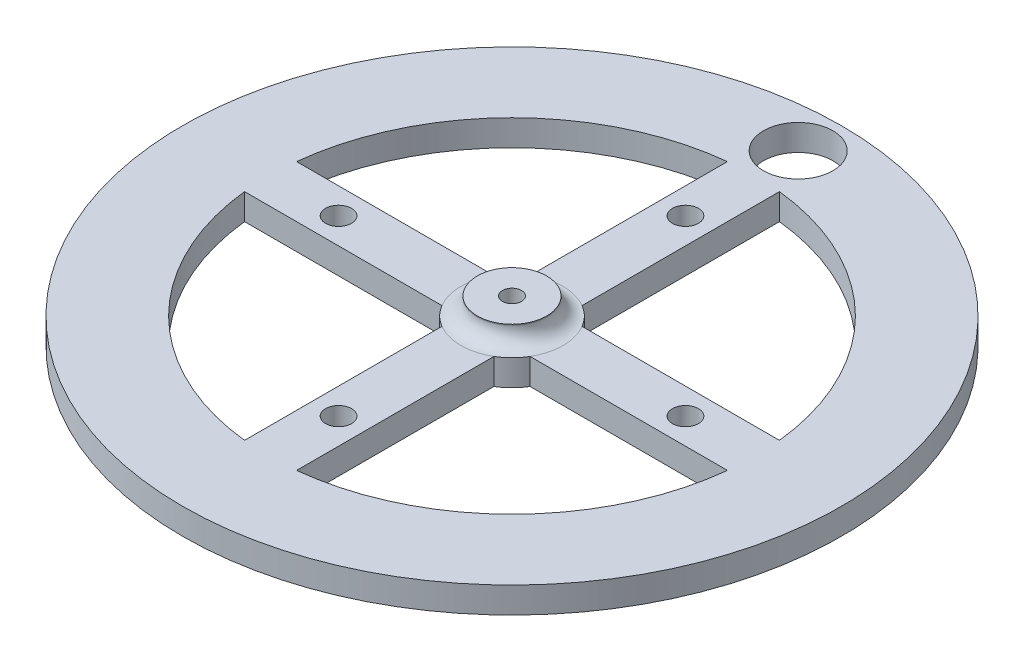
ISO-10303-21;
HEADER;
FILE_DESCRIPTION(('STEP AP214'),'2;1');
FILE_NAME('part.step','',(''),(''),'','','');
FILE_SCHEMA(('AUTOMOTIVE_DESIGN { 1 0 10303 214 1 1 1 1 }'));
ENDSEC;
DATA;
#1=APPLICATION_CONTEXT('core data for automotive mechanical design processes');
#2=APPLICATION_PROTOCOL_DEFINITION('international standard','automotive_design',2000,#1);
#3=PRODUCT_CONTEXT('',#1,'mechanical');
#4=PRODUCT('Part','Part','',(#3));
#5=PRODUCT_RELATED_PRODUCT_CATEGORY('part','',(#4));
#6=PRODUCT_DEFINITION_FORMATION('','',#4);
#7=PRODUCT_DEFINITION_CONTEXT('part definition',#1,'design');
#8=PRODUCT_DEFINITION('design','',#6,#7);
#9=PRODUCT_DEFINITION_SHAPE('','',#8);
#10=(LENGTH_UNIT() NAMED_UNIT(*) SI_UNIT(.MILLI.,.METRE.));
#11=(NAMED_UNIT(*) PLANE_ANGLE_UNIT() SI_UNIT($,.RADIAN.));
#12=(NAMED_UNIT(*) SI_UNIT($,.STERADIAN.) SOLID_ANGLE_UNIT());
#13=UNCERTAINTY_MEASURE_WITH_UNIT(LENGTH_MEASURE(1.E-05),#10,'distance_accuracy_value','');
#14=(GEOMETRIC_REPRESENTATION_CONTEXT(3) GLOBAL_UNCERTAINTY_ASSIGNED_CONTEXT((#13)) GLOBAL_UNIT_ASSIGNED_CONTEXT((#10,
#11,#12)) REPRESENTATION_CONTEXT('',''));
#15=CARTESIAN_POINT('',(0.,0.,0.));
#16=DIRECTION('',(0.,0.,1.));
#17=DIRECTION('',(1.,0.,0.));
#18=AXIS2_PLACEMENT_3D('',#15,#16,#17);
#19=CARTESIAN_POINT('',(4.,5.,0.));
#20=DIRECTION('',(0.,1.,0.));
#21=DIRECTION('',(0.,0.,1.));
#22=AXIS2_PLACEMENT_3D('',#19,#20,#21);
#23=PLANE('',#22);
#24=CARTESIAN_POINT('',(0.,5.,0.));
#25=DIRECTION('',(0.,-1.,0.));
#26=DIRECTION('',(0.,0.,-1.));
#27=AXIS2_PLACEMENT_3D('',#24,#25,#26);
#28=CIRCLE('',#27,1.1);
#29=CARTESIAN_POINT('',(0.,5.,-1.1));
#30=VERTEX_POINT('',#29);
#31=EDGE_CURVE('E297',#30,#30,#28,.T.);
#32=ORIENTED_EDGE('',*,*,#31,.T.);
#33=EDGE_LOOP('',(#32));
#34=FACE_BOUND('',#33,.T.);
#35=CARTESIAN_POINT('',(0.,5.,0.));
#36=DIRECTION('',(0.,-1.,0.));
#37=DIRECTION('',(0.,0.,-1.));
#38=AXIS2_PLACEMENT_3D('',#35,#36,#37);
#39=CIRCLE('',#38,4.);
#40=CARTESIAN_POINT('',(0.,5.,-4.));
#41=VERTEX_POINT('',#40);
#42=EDGE_CURVE('E11',#41,#41,#39,.T.);
#43=ORIENTED_EDGE('',*,*,#42,.F.);
#44=EDGE_LOOP('',(#43));
#45=FACE_BOUND('',#44,.T.);
#46=ADVANCED_FACE('F33',(#34,#45),#23,.T.);
#47=CARTESIAN_POINT('',(0.,0.,0.));
#48=DIRECTION('',(0.,-1.,0.));
#49=DIRECTION('',(0.,0.,-1.));
#50=AXIS2_PLACEMENT_3D('',#47,#48,#49);
#51=CYLINDRICAL_SURFACE('',#50,4.);
#52=ORIENTED_EDGE('',*,*,#42,.T.);
#53=EDGE_LOOP('',(#52));
#54=FACE_BOUND('',#53,.T.);
#55=CARTESIAN_POINT('',(0.,4.9,0.));
#56=DIRECTION('',(0.,-1.,0.));
#57=DIRECTION('',(0.,0.,-1.));
#58=AXIS2_PLACEMENT_3D('',#55,#56,#57);
#59=CIRCLE('',#58,4.);
#60=CARTESIAN_POINT('',(0.,4.9,-4.));
#61=VERTEX_POINT('',#60);
#62=EDGE_CURVE('E41',#61,#61,#59,.T.);
#63=ORIENTED_EDGE('',*,*,#62,.F.);
#64=EDGE_LOOP('',(#63));
#65=FACE_BOUND('',#64,.T.);
#66=ADVANCED_FACE('F351',(#54,#65),#51,.T.);
#67=CARTESIAN_POINT('',(0.,4.9,0.));
#68=DIRECTION('',(0.,-1.,0.));
#69=DIRECTION('',(0.,0.,-1.));
#70=AXIS2_PLACEMENT_3D('',#67,#68,#69);
#71=TOROIDAL_SURFACE('',#70,5.9,1.9);
#72=ORIENTED_EDGE('',*,*,#62,.T.);
#73=EDGE_LOOP('',(#72));
#74=FACE_BOUND('',#73,.T.);
#75=CARTESIAN_POINT('',(0.,3.,0.));
#76=DIRECTION('',(0.,-1.,0.));
#77=DIRECTION('',(0.,0.,-1.));
#78=AXIS2_PLACEMENT_3D('',#75,#76,#77);
#79=CIRCLE('',#78,5.9);
#80=CARTESIAN_POINT('',(3.,3.,-5.08035431835222));
#81=VERTEX_POINT('',#80);
#82=CARTESIAN_POINT('',(5.08035431835222,3.,-3.));
#83=VERTEX_POINT('',#82);
#84=EDGE_CURVE('E310',#81,#83,#79,.T.);
#85=ORIENTED_EDGE('',*,*,#84,.F.);
#86=CARTESIAN_POINT('',(-2.99999999999994,3.,-5.08035431835225));
#87=VERTEX_POINT('',#86);
#88=EDGE_CURVE('E309',#87,#81,#79,.T.);
#89=ORIENTED_EDGE('',*,*,#88,.F.);
#90=CARTESIAN_POINT('',(0.,3.,0.));
#91=DIRECTION('',(0.,1.,0.));
#92=DIRECTION('',(0.,0.,1.));
#93=AXIS2_PLACEMENT_3D('',#90,#91,#92);
#94=CIRCLE('',#93,5.9);
#95=CARTESIAN_POINT('',(-5.08035431835219,3.,-3.00000000000006));
#96=VERTEX_POINT('',#95);
#97=EDGE_CURVE('E228',#96,#87,#94,.F.);
#98=ORIENTED_EDGE('',*,*,#97,.F.);
#99=CARTESIAN_POINT('',(-5.08035431835222,3.,3.));
#100=VERTEX_POINT('',#99);
#101=EDGE_CURVE('E655',#100,#96,#79,.T.);
#102=ORIENTED_EDGE('',*,*,#101,.F.);
#103=CARTESIAN_POINT('',(0.,3.,0.));
#104=DIRECTION('',(0.,1.,0.));
#105=DIRECTION('',(0.,0.,1.));
#106=AXIS2_PLACEMENT_3D('',#103,#104,#105);
#107=CIRCLE('',#106,5.9);
#108=CARTESIAN_POINT('',(-3.,3.,5.08035431835222));
#109=VERTEX_POINT('',#108);
#110=EDGE_CURVE('E237',#109,#100,#107,.F.);
#111=ORIENTED_EDGE('',*,*,#110,.F.);
#112=CARTESIAN_POINT('',(2.99999999999998,3.,5.08035431835223));
#113=VERTEX_POINT('',#112);
#114=EDGE_CURVE('E660',#113,#109,#79,.T.);
#115=ORIENTED_EDGE('',*,*,#114,.F.);
#116=CARTESIAN_POINT('',(0.,3.,0.));
#117=DIRECTION('',(0.,1.,0.));
#118=DIRECTION('',(0.,0.,1.));
#119=AXIS2_PLACEMENT_3D('',#116,#117,#118);
#120=CIRCLE('',#119,5.9);
#121=CARTESIAN_POINT('',(5.08035431835221,3.,3.00000000000002));
#122=VERTEX_POINT('',#121);
#123=EDGE_CURVE('E245',#122,#113,#120,.F.);
#124=ORIENTED_EDGE('',*,*,#123,.F.);
#125=EDGE_CURVE('E312',#83,#122,#79,.T.);
#126=ORIENTED_EDGE('',*,*,#125,.F.);
#127=EDGE_LOOP('',(#85,#89,#98,#102,#111,#115,#124,#126));
#128=FACE_BOUND('',#127,.T.);
#129=ADVANCED_FACE('F356',(#74,#128),#71,.F.);
#130=CARTESIAN_POINT('',(38.,3.,0.));
#131=DIRECTION('',(0.,1.,0.));
#132=DIRECTION('',(0.,0.,1.));
#133=AXIS2_PLACEMENT_3D('',#130,#131,#132);
#134=PLANE('',#133);
#135=CARTESIAN_POINT('',(0.,3.,-33.));
#136=DIRECTION('',(0.,1.,0.));
#137=DIRECTION('',(0.,0.,1.));
#138=AXIS2_PLACEMENT_3D('',#135,#136,#137);
#139=CIRCLE('',#138,4.);
#140=CARTESIAN_POINT('',(0.,3.,-29.));
#141=VERTEX_POINT('',#140);
#142=EDGE_CURVE('E175',#141,#141,#139,.T.);
#143=ORIENTED_EDGE('',*,*,#142,.F.);
#144=EDGE_LOOP('',(#143));
#145=FACE_BOUND('',#144,.T.);
#146=DIRECTION('',(0.,0.,1.));
#147=VECTOR('',#146,1.);
#148=CARTESIAN_POINT('',(3.,3.,-1.15532315873911E-13));
#149=LINE('',#148,#147);
#150=CARTESIAN_POINT('',(2.9999999999999,3.,27.8388218141501));
#151=VERTEX_POINT('',#150);
#152=EDGE_CURVE('E247',#113,#151,#149,.T.);
#153=ORIENTED_EDGE('',*,*,#152,.F.);
#154=ORIENTED_EDGE('',*,*,#114,.T.);
#155=DIRECTION('',(0.,0.,-1.));
#156=VECTOR('',#155,1.);
#157=CARTESIAN_POINT('',(-3.00000000000001,3.,0.));
#158=LINE('',#157,#156);
#159=CARTESIAN_POINT('',(-3.00000000000001,3.,27.8388218141501));
#160=VERTEX_POINT('',#159);
#161=EDGE_CURVE('E235',#160,#109,#158,.T.);
#162=ORIENTED_EDGE('',*,*,#161,.F.);
#163=CARTESIAN_POINT('',(0.,3.,0.));
#164=DIRECTION('',(0.,1.,0.));
#165=DIRECTION('',(0.,0.,1.));
#166=AXIS2_PLACEMENT_3D('',#163,#164,#165);
#167=CIRCLE('',#166,28.);
#168=CARTESIAN_POINT('',(-27.8388218141501,3.,3.));
#169=VERTEX_POINT('',#168);
#170=EDGE_CURVE('E241',#169,#160,#167,.T.);
#171=ORIENTED_EDGE('',*,*,#170,.F.);
#172=DIRECTION('',(-1.,0.,0.));
#173=VECTOR('',#172,1.);
#174=CARTESIAN_POINT('',(38.,3.,2.99999999999999));
#175=LINE('',#174,#173);
#176=EDGE_CURVE('E239',#100,#169,#175,.T.);
#177=ORIENTED_EDGE('',*,*,#176,.F.);
#178=ORIENTED_EDGE('',*,*,#101,.T.);
#179=DIRECTION('',(1.,0.,0.));
#180=VECTOR('',#179,1.);
#181=CARTESIAN_POINT('',(38.,3.,-2.99999999999961));
#182=LINE('',#181,#180);
#183=CARTESIAN_POINT('',(-27.8388218141501,3.,-3.00000000000029));
#184=VERTEX_POINT('',#183);
#185=EDGE_CURVE('E181',#184,#96,#182,.T.);
#186=ORIENTED_EDGE('',*,*,#185,.F.);
#187=CARTESIAN_POINT('',(0.,3.,0.));
#188=DIRECTION('',(0.,1.,0.));
#189=DIRECTION('',(0.,0.,1.));
#190=AXIS2_PLACEMENT_3D('',#187,#188,#189);
#191=CIRCLE('',#190,28.);
#192=CARTESIAN_POINT('',(-2.99999999999971,3.,-27.8388218141501));
#193=VERTEX_POINT('',#192);
#194=EDGE_CURVE('E232',#193,#184,#191,.T.);
#195=ORIENTED_EDGE('',*,*,#194,.F.);
#196=DIRECTION('',(0.,0.,-1.));
#197=VECTOR('',#196,1.);
#198=CARTESIAN_POINT('',(-3.,3.,-4.21639325523147E-13));
#199=LINE('',#198,#197);
#200=EDGE_CURVE('E230',#87,#193,#199,.T.);
#201=ORIENTED_EDGE('',*,*,#200,.F.);
#202=ORIENTED_EDGE('',*,*,#88,.T.);
#203=DIRECTION('',(0.,0.,1.));
#204=VECTOR('',#203,1.);
#205=CARTESIAN_POINT('',(3.00000000000001,3.,0.));
#206=LINE('',#205,#204);
#207=CARTESIAN_POINT('',(3.00000000000001,3.,-27.8388218141501));
#208=VERTEX_POINT('',#207);
#209=EDGE_CURVE('E278',#208,#81,#206,.T.);
#210=ORIENTED_EDGE('',*,*,#209,.F.);
#211=CARTESIAN_POINT('',(0.,3.,0.));
#212=DIRECTION('',(0.,1.,0.));
#213=DIRECTION('',(0.,0.,1.));
#214=AXIS2_PLACEMENT_3D('',#211,#212,#213);
#215=CIRCLE('',#214,28.);
#216=CARTESIAN_POINT('',(27.8388218141501,3.,-3.));
#217=VERTEX_POINT('',#216);
#218=EDGE_CURVE('E290',#217,#208,#215,.T.);
#219=ORIENTED_EDGE('',*,*,#218,.F.);
#220=DIRECTION('',(1.,0.,0.));
#221=VECTOR('',#220,1.);
#222=CARTESIAN_POINT('',(38.,3.,-3.));
#223=LINE('',#222,#221);
#224=EDGE_CURVE('E288',#83,#217,#223,.T.);
#225=ORIENTED_EDGE('',*,*,#224,.F.);
#226=ORIENTED_EDGE('',*,*,#125,.T.);
#227=DIRECTION('',(-1.,0.,0.));
#228=VECTOR('',#227,1.);
#229=CARTESIAN_POINT('',(38.,3.,3.00000000000013));
#230=LINE('',#229,#228);
#231=CARTESIAN_POINT('',(27.8388218141501,3.,3.0000000000001));
#232=VERTEX_POINT('',#231);
#233=EDGE_CURVE('E243',#232,#122,#230,.T.);
#234=ORIENTED_EDGE('',*,*,#233,.F.);
#235=CARTESIAN_POINT('',(0.,3.,0.));
#236=DIRECTION('',(0.,1.,0.));
#237=DIRECTION('',(0.,0.,1.));
#238=AXIS2_PLACEMENT_3D('',#235,#236,#237);
#239=CIRCLE('',#238,28.);
#240=EDGE_CURVE('E152',#151,#232,#239,.T.);
#241=ORIENTED_EDGE('',*,*,#240,.F.);
#242=EDGE_LOOP('',(#153,#154,#162,#171,#177,#178,#186,#195,#201,#202,#210,#219,#225,#226,#234,#241));
#243=FACE_BOUND('',#242,.T.);
#244=CARTESIAN_POINT('',(20.,3.,0.));
#245=DIRECTION('',(0.,1.,0.));
#246=DIRECTION('',(0.,0.,1.));
#247=AXIS2_PLACEMENT_3D('',#244,#245,#246);
#248=CIRCLE('',#247,1.5);
#249=CARTESIAN_POINT('',(20.,3.,1.50000000000007));
#250=VERTEX_POINT('',#249);
#251=EDGE_CURVE('E259',#250,#250,#248,.T.);
#252=ORIENTED_EDGE('',*,*,#251,.F.);
#253=EDGE_LOOP('',(#252));
#254=FACE_BOUND('',#253,.T.);
#255=CARTESIAN_POINT('',(0.,3.,20.));
#256=DIRECTION('',(0.,1.,0.));
#257=DIRECTION('',(0.,0.,1.));
#258=AXIS2_PLACEMENT_3D('',#255,#256,#257);
#259=CIRCLE('',#258,1.5);
#260=CARTESIAN_POINT('',(0.,3.,21.5));
#261=VERTEX_POINT('',#260);
#262=EDGE_CURVE('E255',#261,#261,#259,.T.);
#263=ORIENTED_EDGE('',*,*,#262,.F.);
#264=EDGE_LOOP('',(#263));
#265=FACE_BOUND('',#264,.T.);
#266=CARTESIAN_POINT('',(-20.,3.,-2.09488880330588E-13));
#267=DIRECTION('',(0.,1.,0.));
#268=DIRECTION('',(0.,0.,1.));
#269=AXIS2_PLACEMENT_3D('',#266,#267,#268);
#270=CIRCLE('',#269,1.5);
#271=CARTESIAN_POINT('',(-20.,3.,1.49999999999979));
#272=VERTEX_POINT('',#271);
#273=EDGE_CURVE('E251',#272,#272,#270,.T.);
#274=ORIENTED_EDGE('',*,*,#273,.F.);
#275=EDGE_LOOP('',(#274));
#276=FACE_BOUND('',#275,.T.);
#277=CARTESIAN_POINT('',(0.,3.,-20.));
#278=DIRECTION('',(0.,1.,0.));
#279=DIRECTION('',(0.,0.,1.));
#280=AXIS2_PLACEMENT_3D('',#277,#278,#279);
#281=CIRCLE('',#280,1.5);
#282=CARTESIAN_POINT('',(0.,3.,-18.5));
#283=VERTEX_POINT('',#282);
#284=EDGE_CURVE('E294',#283,#283,#281,.T.);
#285=ORIENTED_EDGE('',*,*,#284,.F.);
#286=EDGE_LOOP('',(#285));
#287=FACE_BOUND('',#286,.T.);
#288=CARTESIAN_POINT('',(0.,3.,0.));
#289=DIRECTION('',(0.,-1.,0.));
#290=DIRECTION('',(0.,0.,-1.));
#291=AXIS2_PLACEMENT_3D('',#288,#289,#290);
#292=CIRCLE('',#291,38.);
#293=CARTESIAN_POINT('',(0.,3.,-38.));
#294=VERTEX_POINT('',#293);
#295=EDGE_CURVE('E306',#294,#294,#292,.T.);
#296=ORIENTED_EDGE('',*,*,#295,.F.);
#297=EDGE_LOOP('',(#296));
#298=FACE_BOUND('',#297,.T.);
#299=ADVANCED_FACE('F361',(#145,#243,#254,#265,#276,#287,#298),#134,.T.);
#300=CARTESIAN_POINT('',(0.,0.,0.));
#301=DIRECTION('',(0.,-1.,0.));
#302=DIRECTION('',(0.,0.,-1.));
#303=AXIS2_PLACEMENT_3D('',#300,#301,#302);
#304=CYLINDRICAL_SURFACE('',#303,38.);
#305=ORIENTED_EDGE('',*,*,#295,.T.);
#306=EDGE_LOOP('',(#305));
#307=FACE_BOUND('',#306,.T.);
#308=CARTESIAN_POINT('',(0.,0.,0.));
#309=DIRECTION('',(0.,-1.,0.));
#310=DIRECTION('',(0.,0.,-1.));
#311=AXIS2_PLACEMENT_3D('',#308,#309,#310);
#312=CIRCLE('',#311,38.);
#313=CARTESIAN_POINT('',(0.,0.,-38.));
#314=VERTEX_POINT('',#313);
#315=EDGE_CURVE('E303',#314,#314,#312,.T.);
#316=ORIENTED_EDGE('',*,*,#315,.F.);
#317=EDGE_LOOP('',(#316));
#318=FACE_BOUND('',#317,.T.);
#319=ADVANCED_FACE('F328',(#307,#318),#304,.T.);
#320=CARTESIAN_POINT('',(1.1,0.,0.));
#321=DIRECTION('',(0.,-1.,0.));
#322=DIRECTION('',(0.,0.,-1.));
#323=AXIS2_PLACEMENT_3D('',#320,#321,#322);
#324=PLANE('',#323);
#325=CARTESIAN_POINT('',(0.,0.,-33.));
#326=DIRECTION('',(0.,-1.,0.));
#327=DIRECTION('',(0.,0.,-1.));
#328=AXIS2_PLACEMENT_3D('',#325,#326,#327);
#329=CIRCLE('',#328,4.);
#330=CARTESIAN_POINT('',(0.,0.,-37.));
#331=VERTEX_POINT('',#330);
#332=EDGE_CURVE('E36',#331,#331,#329,.T.);
#333=ORIENTED_EDGE('',*,*,#332,.F.);
#334=EDGE_LOOP('',(#333));
#335=FACE_BOUND('',#334,.T.);
#336=CARTESIAN_POINT('',(0.,0.,0.));
#337=DIRECTION('',(0.,1.,0.));
#338=DIRECTION('',(-1.,0.,0.));
#339=AXIS2_PLACEMENT_3D('',#336,#337,#338);
#340=CIRCLE('',#339,28.);
#341=CARTESIAN_POINT('',(2.9999999999999,0.,27.8388218141501));
#342=VERTEX_POINT('',#341);
#343=CARTESIAN_POINT('',(27.8388218141501,0.,3.0000000000001));
#344=VERTEX_POINT('',#343);
#345=EDGE_CURVE('E149',#342,#344,#340,.T.);
#346=ORIENTED_EDGE('',*,*,#345,.T.);
#347=DIRECTION('',(-1.,0.,0.));
#348=VECTOR('',#347,1.);
#349=CARTESIAN_POINT('',(27.8388218141501,0.,3.0000000000001));
#350=LINE('',#349,#348);
#351=CARTESIAN_POINT('',(5.08035431835221,0.,3.00000000000002));
#352=VERTEX_POINT('',#351);
#353=EDGE_CURVE('E159',#344,#352,#350,.T.);
#354=ORIENTED_EDGE('',*,*,#353,.T.);
#355=CARTESIAN_POINT('',(0.,0.,0.));
#356=DIRECTION('',(0.,-1.,0.));
#357=DIRECTION('',(-1.,0.,0.));
#358=AXIS2_PLACEMENT_3D('',#355,#356,#357);
#359=CIRCLE('',#358,5.9);
#360=CARTESIAN_POINT('',(2.99999999999998,0.,5.08035431835223));
#361=VERTEX_POINT('',#360);
#362=EDGE_CURVE('E164',#352,#361,#359,.T.);
#363=ORIENTED_EDGE('',*,*,#362,.T.);
#364=DIRECTION('',(0.,0.,1.));
#365=VECTOR('',#364,1.);
#366=CARTESIAN_POINT('',(2.9999999999999,0.,27.8388218141501));
#367=LINE('',#366,#365);
#368=EDGE_CURVE('E155',#361,#342,#367,.T.);
#369=ORIENTED_EDGE('',*,*,#368,.T.);
#370=EDGE_LOOP('',(#346,#354,#363,#369));
#371=FACE_BOUND('',#370,.T.);
#372=CARTESIAN_POINT('',(0.,0.,0.));
#373=DIRECTION('',(0.,1.,0.));
#374=DIRECTION('',(0.,0.,-1.));
#375=AXIS2_PLACEMENT_3D('',#372,#373,#374);
#376=CIRCLE('',#375,28.);
#377=CARTESIAN_POINT('',(-27.8388218141501,0.,3.));
#378=VERTEX_POINT('',#377);
#379=CARTESIAN_POINT('',(-3.,0.,27.8388218141501));
#380=VERTEX_POINT('',#379);
#381=EDGE_CURVE('E186',#378,#380,#376,.T.);
#382=ORIENTED_EDGE('',*,*,#381,.T.);
#383=DIRECTION('',(0.,0.,-1.));
#384=VECTOR('',#383,1.);
#385=CARTESIAN_POINT('',(-3.,0.,27.8388218141501));
#386=LINE('',#385,#384);
#387=CARTESIAN_POINT('',(-3.,0.,5.08035431835222));
#388=VERTEX_POINT('',#387);
#389=EDGE_CURVE('E189',#380,#388,#386,.T.);
#390=ORIENTED_EDGE('',*,*,#389,.T.);
#391=CARTESIAN_POINT('',(0.,0.,0.));
#392=DIRECTION('',(0.,-1.,0.));
#393=DIRECTION('',(0.,0.,-1.));
#394=AXIS2_PLACEMENT_3D('',#391,#392,#393);
#395=CIRCLE('',#394,5.9);
#396=CARTESIAN_POINT('',(-5.08035431835222,0.,3.));
#397=VERTEX_POINT('',#396);
#398=EDGE_CURVE('E193',#388,#397,#395,.T.);
#399=ORIENTED_EDGE('',*,*,#398,.T.);
#400=DIRECTION('',(-1.,0.,0.));
#401=VECTOR('',#400,1.);
#402=CARTESIAN_POINT('',(-27.8388218141501,0.,3.));
#403=LINE('',#402,#401);
#404=EDGE_CURVE('E196',#397,#378,#403,.T.);
#405=ORIENTED_EDGE('',*,*,#404,.T.);
#406=EDGE_LOOP('',(#382,#390,#399,#405));
#407=FACE_BOUND('',#406,.T.);
#408=CARTESIAN_POINT('',(0.,0.,0.));
#409=DIRECTION('',(0.,1.,0.));
#410=DIRECTION('',(1.,0.,0.));
#411=AXIS2_PLACEMENT_3D('',#408,#409,#410);
#412=CIRCLE('',#411,28.);
#413=CARTESIAN_POINT('',(-2.99999999999971,0.,-27.8388218141501));
#414=VERTEX_POINT('',#413);
#415=CARTESIAN_POINT('',(-27.8388218141501,0.,-3.00000000000029));
#416=VERTEX_POINT('',#415);
#417=EDGE_CURVE('E205',#414,#416,#412,.T.);
#418=ORIENTED_EDGE('',*,*,#417,.T.);
#419=DIRECTION('',(1.,0.,0.));
#420=VECTOR('',#419,1.);
#421=CARTESIAN_POINT('',(-27.8388218141501,0.,-3.00000000000029));
#422=LINE('',#421,#420);
#423=CARTESIAN_POINT('',(-5.08035431835219,0.,-3.00000000000006));
#424=VERTEX_POINT('',#423);
#425=EDGE_CURVE('E208',#416,#424,#422,.T.);
#426=ORIENTED_EDGE('',*,*,#425,.T.);
#427=CARTESIAN_POINT('',(0.,0.,0.));
#428=DIRECTION('',(0.,-1.,0.));
#429=DIRECTION('',(1.,0.,0.));
#430=AXIS2_PLACEMENT_3D('',#427,#428,#429);
#431=CIRCLE('',#430,5.9);
#432=CARTESIAN_POINT('',(-2.99999999999994,0.,-5.08035431835225));
#433=VERTEX_POINT('',#432);
#434=EDGE_CURVE('E211',#424,#433,#431,.T.);
#435=ORIENTED_EDGE('',*,*,#434,.T.);
#436=DIRECTION('',(0.,0.,-1.));
#437=VECTOR('',#436,1.);
#438=CARTESIAN_POINT('',(-2.99999999999971,0.,-27.8388218141501));
#439=LINE('',#438,#437);
#440=EDGE_CURVE('E214',#433,#414,#439,.T.);
#441=ORIENTED_EDGE('',*,*,#440,.T.);
#442=EDGE_LOOP('',(#418,#426,#435,#441));
#443=FACE_BOUND('',#442,.T.);
#444=CARTESIAN_POINT('',(20.,0.,0.));
#445=DIRECTION('',(0.,-1.,0.));
#446=DIRECTION('',(0.,0.,-1.));
#447=AXIS2_PLACEMENT_3D('',#444,#445,#446);
#448=CIRCLE('',#447,1.5);
#449=CARTESIAN_POINT('',(20.,0.,-1.49999999999993));
#450=VERTEX_POINT('',#449);
#451=EDGE_CURVE('E258',#450,#450,#448,.T.);
#452=ORIENTED_EDGE('',*,*,#451,.F.);
#453=EDGE_LOOP('',(#452));
#454=FACE_BOUND('',#453,.T.);
#455=CARTESIAN_POINT('',(0.,0.,20.));
#456=DIRECTION('',(0.,-1.,0.));
#457=DIRECTION('',(0.,0.,-1.));
#458=AXIS2_PLACEMENT_3D('',#455,#456,#457);
#459=CIRCLE('',#458,1.5);
#460=CARTESIAN_POINT('',(0.,0.,18.5));
#461=VERTEX_POINT('',#460);
#462=EDGE_CURVE('E254',#461,#461,#459,.T.);
#463=ORIENTED_EDGE('',*,*,#462,.F.);
#464=EDGE_LOOP('',(#463));
#465=FACE_BOUND('',#464,.T.);
#466=CARTESIAN_POINT('',(-20.,0.,-2.09488880330588E-13));
#467=DIRECTION('',(0.,-1.,0.));
#468=DIRECTION('',(0.,0.,-1.));
#469=AXIS2_PLACEMENT_3D('',#466,#467,#468);
#470=CIRCLE('',#469,1.5);
#471=CARTESIAN_POINT('',(-20.,0.,-1.50000000000021));
#472=VERTEX_POINT('',#471);
#473=EDGE_CURVE('E250',#472,#472,#470,.T.);
#474=ORIENTED_EDGE('',*,*,#473,.F.);
#475=EDGE_LOOP('',(#474));
#476=FACE_BOUND('',#475,.T.);
#477=CARTESIAN_POINT('',(0.,0.,0.));
#478=DIRECTION('',(0.,1.,0.));
#479=DIRECTION('',(0.,0.,1.));
#480=AXIS2_PLACEMENT_3D('',#477,#478,#479);
#481=CIRCLE('',#480,28.);
#482=CARTESIAN_POINT('',(27.8388218141501,0.,-3.));
#483=VERTEX_POINT('',#482);
#484=CARTESIAN_POINT('',(3.,0.,-27.8388218141501));
#485=VERTEX_POINT('',#484);
#486=EDGE_CURVE('E262',#483,#485,#481,.T.);
#487=ORIENTED_EDGE('',*,*,#486,.T.);
#488=DIRECTION('',(0.,0.,1.));
#489=VECTOR('',#488,1.);
#490=CARTESIAN_POINT('',(3.,0.,-27.8388218141501));
#491=LINE('',#490,#489);
#492=CARTESIAN_POINT('',(3.,0.,-5.08035431835222));
#493=VERTEX_POINT('',#492);
#494=EDGE_CURVE('E265',#485,#493,#491,.T.);
#495=ORIENTED_EDGE('',*,*,#494,.T.);
#496=CARTESIAN_POINT('',(0.,0.,0.));
#497=DIRECTION('',(0.,-1.,0.));
#498=DIRECTION('',(0.,0.,1.));
#499=AXIS2_PLACEMENT_3D('',#496,#497,#498);
#500=CIRCLE('',#499,5.9);
#501=CARTESIAN_POINT('',(5.08035431835222,0.,-3.));
#502=VERTEX_POINT('',#501);
#503=EDGE_CURVE('E268',#493,#502,#500,.T.);
#504=ORIENTED_EDGE('',*,*,#503,.T.);
#505=DIRECTION('',(1.,0.,0.));
#506=VECTOR('',#505,1.);
#507=CARTESIAN_POINT('',(27.8388218141501,0.,-3.));
#508=LINE('',#507,#506);
#509=EDGE_CURVE('E271',#502,#483,#508,.T.);
#510=ORIENTED_EDGE('',*,*,#509,.T.);
#511=EDGE_LOOP('',(#487,#495,#504,#510));
#512=FACE_BOUND('',#511,.T.);
#513=CARTESIAN_POINT('',(0.,0.,-20.));
#514=DIRECTION('',(0.,-1.,0.));
#515=DIRECTION('',(0.,0.,-1.));
#516=AXIS2_PLACEMENT_3D('',#513,#514,#515);
#517=CIRCLE('',#516,1.5);
#518=CARTESIAN_POINT('',(0.,0.,-21.5));
#519=VERTEX_POINT('',#518);
#520=EDGE_CURVE('E293',#519,#519,#517,.T.);
#521=ORIENTED_EDGE('',*,*,#520,.F.);
#522=EDGE_LOOP('',(#521));
#523=FACE_BOUND('',#522,.T.);
#524=ORIENTED_EDGE('',*,*,#315,.T.);
#525=EDGE_LOOP('',(#524));
#526=FACE_BOUND('',#525,.T.);
#527=CARTESIAN_POINT('',(0.,0.,0.));
#528=DIRECTION('',(0.,-1.,0.));
#529=DIRECTION('',(0.,0.,-1.));
#530=AXIS2_PLACEMENT_3D('',#527,#528,#529);
#531=CIRCLE('',#530,1.1);
#532=CARTESIAN_POINT('',(0.,0.,-1.1));
#533=VERTEX_POINT('',#532);
#534=EDGE_CURVE('E300',#533,#533,#531,.T.);
#535=ORIENTED_EDGE('',*,*,#534,.F.);
#536=EDGE_LOOP('',(#535));
#537=FACE_BOUND('',#536,.T.);
#538=ADVANCED_FACE('F166',(#335,#371,#407,#443,#454,#465,#476,#512,#523,#526,#537),#324,.T.);
#539=CARTESIAN_POINT('',(0.,0.,0.));
#540=DIRECTION('',(0.,-1.,0.));
#541=DIRECTION('',(0.,0.,-1.));
#542=AXIS2_PLACEMENT_3D('',#539,#540,#541);
#543=CYLINDRICAL_SURFACE('',#542,1.1);
#544=ORIENTED_EDGE('',*,*,#534,.T.);
#545=EDGE_LOOP('',(#544));
#546=FACE_BOUND('',#545,.T.);
#547=ORIENTED_EDGE('',*,*,#31,.F.);
#548=EDGE_LOOP('',(#547));
#549=FACE_BOUND('',#548,.T.);
#550=ADVANCED_FACE('F327',(#546,#549),#543,.F.);
#551=CARTESIAN_POINT('',(0.,-1.2E-05,-20.));
#552=DIRECTION('',(0.,1.,0.));
#553=DIRECTION('',(0.,0.,1.));
#554=AXIS2_PLACEMENT_3D('',#551,#552,#553);
#555=CYLINDRICAL_SURFACE('',#554,1.5);
#556=ORIENTED_EDGE('',*,*,#284,.T.);
#557=EDGE_LOOP('',(#556));
#558=FACE_BOUND('',#557,.T.);
#559=ORIENTED_EDGE('',*,*,#520,.T.);
#560=EDGE_LOOP('',(#559));
#561=FACE_BOUND('',#560,.T.);
#562=ADVANCED_FACE('F345',(#558,#561),#555,.F.);
#563=CARTESIAN_POINT('',(0.,0.,0.));
#564=DIRECTION('',(0.,1.,0.));
#565=DIRECTION('',(0.,0.,1.));
#566=AXIS2_PLACEMENT_3D('',#563,#564,#565);
#567=CYLINDRICAL_SURFACE('',#566,28.);
#568=ORIENTED_EDGE('',*,*,#218,.T.);
#569=DIRECTION('',(0.,1.,0.));
#570=VECTOR('',#569,1.);
#571=CARTESIAN_POINT('',(3.,0.,-27.8388218141501));
#572=LINE('',#571,#570);
#573=EDGE_CURVE('E274',#485,#208,#572,.T.);
#574=ORIENTED_EDGE('',*,*,#573,.F.);
#575=ORIENTED_EDGE('',*,*,#486,.F.);
#576=DIRECTION('',(0.,1.,0.));
#577=VECTOR('',#576,1.);
#578=CARTESIAN_POINT('',(27.8388218141501,0.,-3.));
#579=LINE('',#578,#577);
#580=EDGE_CURVE('E275',#483,#217,#579,.T.);
#581=ORIENTED_EDGE('',*,*,#580,.T.);
#582=EDGE_LOOP('',(#568,#574,#575,#581));
#583=FACE_BOUND('',#582,.T.);
#584=ADVANCED_FACE('F382',(#583),#567,.F.);
#585=CARTESIAN_POINT('',(27.8388218141501,0.,-3.));
#586=DIRECTION('',(0.,0.,1.));
#587=DIRECTION('',(1.,0.,0.));
#588=AXIS2_PLACEMENT_3D('',#585,#586,#587);
#589=PLANE('',#588);
#590=ORIENTED_EDGE('',*,*,#224,.T.);
#591=ORIENTED_EDGE('',*,*,#580,.F.);
#592=ORIENTED_EDGE('',*,*,#509,.F.);
#593=DIRECTION('',(0.,1.,0.));
#594=VECTOR('',#593,1.);
#595=CARTESIAN_POINT('',(5.08035431835222,0.,-3.));
#596=LINE('',#595,#594);
#597=EDGE_CURVE('E279',#502,#83,#596,.T.);
#598=ORIENTED_EDGE('',*,*,#597,.T.);
#599=EDGE_LOOP('',(#590,#591,#592,#598));
#600=FACE_BOUND('',#599,.T.);
#601=ADVANCED_FACE('F375',(#600),#589,.F.);
#602=CARTESIAN_POINT('',(0.,0.,0.));
#603=DIRECTION('',(0.,1.,0.));
#604=DIRECTION('',(0.,0.,1.));
#605=AXIS2_PLACEMENT_3D('',#602,#603,#604);
#606=CYLINDRICAL_SURFACE('',#605,5.9);
#607=ORIENTED_EDGE('',*,*,#84,.T.);
#608=ORIENTED_EDGE('',*,*,#597,.F.);
#609=ORIENTED_EDGE('',*,*,#503,.F.);
#610=DIRECTION('',(0.,1.,0.));
#611=VECTOR('',#610,1.);
#612=CARTESIAN_POINT('',(3.,0.,-5.08035431835222));
#613=LINE('',#612,#611);
#614=EDGE_CURVE('E282',#493,#81,#613,.T.);
#615=ORIENTED_EDGE('',*,*,#614,.T.);
#616=EDGE_LOOP('',(#607,#608,#609,#615));
#617=FACE_BOUND('',#616,.T.);
#618=ADVANCED_FACE('F370',(#617),#606,.T.);
#619=CARTESIAN_POINT('',(3.,0.,-27.8388218141501));
#620=DIRECTION('',(-1.,0.,0.));
#621=DIRECTION('',(0.,0.,1.));
#622=AXIS2_PLACEMENT_3D('',#619,#620,#621);
#623=PLANE('',#622);
#624=ORIENTED_EDGE('',*,*,#209,.T.);
#625=ORIENTED_EDGE('',*,*,#614,.F.);
#626=ORIENTED_EDGE('',*,*,#494,.F.);
#627=ORIENTED_EDGE('',*,*,#573,.T.);
#628=EDGE_LOOP('',(#624,#625,#626,#627));
#629=FACE_BOUND('',#628,.T.);
#630=ADVANCED_FACE('F385',(#629),#623,.F.);
#631=CARTESIAN_POINT('',(-20.,-1.2E-05,-2.09488880330588E-13));
#632=DIRECTION('',(0.,1.,0.));
#633=DIRECTION('',(0.,0.,1.));
#634=AXIS2_PLACEMENT_3D('',#631,#632,#633);
#635=CYLINDRICAL_SURFACE('',#634,1.5);
#636=ORIENTED_EDGE('',*,*,#273,.T.);
#637=EDGE_LOOP('',(#636));
#638=FACE_BOUND('',#637,.T.);
#639=ORIENTED_EDGE('',*,*,#473,.T.);
#640=EDGE_LOOP('',(#639));
#641=FACE_BOUND('',#640,.T.);
#642=ADVANCED_FACE('F387',(#638,#641),#635,.F.);
#643=CARTESIAN_POINT('',(0.,-1.2E-05,20.));
#644=DIRECTION('',(0.,1.,0.));
#645=DIRECTION('',(0.,0.,1.));
#646=AXIS2_PLACEMENT_3D('',#643,#644,#645);
#647=CYLINDRICAL_SURFACE('',#646,1.5);
#648=ORIENTED_EDGE('',*,*,#262,.T.);
#649=EDGE_LOOP('',(#648));
#650=FACE_BOUND('',#649,.T.);
#651=ORIENTED_EDGE('',*,*,#462,.T.);
#652=EDGE_LOOP('',(#651));
#653=FACE_BOUND('',#652,.T.);
#654=ADVANCED_FACE('F393',(#650,#653),#647,.F.);
#655=CARTESIAN_POINT('',(20.,-1.2E-05,0.));
#656=DIRECTION('',(0.,1.,0.));
#657=DIRECTION('',(0.,0.,1.));
#658=AXIS2_PLACEMENT_3D('',#655,#656,#657);
#659=CYLINDRICAL_SURFACE('',#658,1.5);
#660=ORIENTED_EDGE('',*,*,#251,.T.);
#661=EDGE_LOOP('',(#660));
#662=FACE_BOUND('',#661,.T.);
#663=ORIENTED_EDGE('',*,*,#451,.T.);
#664=EDGE_LOOP('',(#663));
#665=FACE_BOUND('',#664,.T.);
#666=ADVANCED_FACE('F323',(#662,#665),#659,.F.);
#667=CARTESIAN_POINT('',(0.,0.,0.));
#668=DIRECTION('',(0.,1.,0.));
#669=DIRECTION('',(0.,0.,1.));
#670=AXIS2_PLACEMENT_3D('',#667,#668,#669);
#671=CYLINDRICAL_SURFACE('',#670,28.);
#672=ORIENTED_EDGE('',*,*,#194,.T.);
#673=DIRECTION('',(0.,1.,0.));
#674=VECTOR('',#673,1.);
#675=CARTESIAN_POINT('',(-27.8388218141501,0.,-3.00000000000029));
#676=LINE('',#675,#674);
#677=EDGE_CURVE('E217',#416,#184,#676,.T.);
#678=ORIENTED_EDGE('',*,*,#677,.F.);
#679=ORIENTED_EDGE('',*,*,#417,.F.);
#680=DIRECTION('',(0.,1.,0.));
#681=VECTOR('',#680,1.);
#682=CARTESIAN_POINT('',(-2.99999999999971,0.,-27.8388218141501));
#683=LINE('',#682,#681);
#684=EDGE_CURVE('E190',#414,#193,#683,.T.);
#685=ORIENTED_EDGE('',*,*,#684,.T.);
#686=EDGE_LOOP('',(#672,#678,#679,#685));
#687=FACE_BOUND('',#686,.T.);
#688=ADVANCED_FACE('F455',(#687),#671,.F.);
#689=CARTESIAN_POINT('',(-2.99999999999971,0.,-27.8388218141501));
#690=DIRECTION('',(1.,0.,0.));
#691=DIRECTION('',(0.,0.,-1.));
#692=AXIS2_PLACEMENT_3D('',#689,#690,#691);
#693=PLANE('',#692);
#694=ORIENTED_EDGE('',*,*,#200,.T.);
#695=ORIENTED_EDGE('',*,*,#684,.F.);
#696=ORIENTED_EDGE('',*,*,#440,.F.);
#697=DIRECTION('',(0.,1.,0.));
#698=VECTOR('',#697,1.);
#699=CARTESIAN_POINT('',(-2.99999999999994,0.,-5.08035431835225));
#700=LINE('',#699,#698);
#701=EDGE_CURVE('E220',#433,#87,#700,.T.);
#702=ORIENTED_EDGE('',*,*,#701,.T.);
#703=EDGE_LOOP('',(#694,#695,#696,#702));
#704=FACE_BOUND('',#703,.T.);
#705=ADVANCED_FACE('F451',(#704),#693,.F.);
#706=CARTESIAN_POINT('',(0.,0.,0.));
#707=DIRECTION('',(0.,1.,0.));
#708=DIRECTION('',(0.,0.,1.));
#709=AXIS2_PLACEMENT_3D('',#706,#707,#708);
#710=CYLINDRICAL_SURFACE('',#709,5.9);
#711=ORIENTED_EDGE('',*,*,#97,.T.);
#712=ORIENTED_EDGE('',*,*,#701,.F.);
#713=ORIENTED_EDGE('',*,*,#434,.F.);
#714=DIRECTION('',(0.,1.,0.));
#715=VECTOR('',#714,1.);
#716=CARTESIAN_POINT('',(-5.08035431835219,0.,-3.00000000000006));
#717=LINE('',#716,#715);
#718=EDGE_CURVE('E223',#424,#96,#717,.T.);
#719=ORIENTED_EDGE('',*,*,#718,.T.);
#720=EDGE_LOOP('',(#711,#712,#713,#719));
#721=FACE_BOUND('',#720,.T.);
#722=ADVANCED_FACE('F454',(#721),#710,.T.);
#723=CARTESIAN_POINT('',(-27.8388218141501,0.,-3.00000000000029));
#724=DIRECTION('',(0.,0.,1.));
#725=DIRECTION('',(1.,0.,0.));
#726=AXIS2_PLACEMENT_3D('',#723,#724,#725);
#727=PLANE('',#726);
#728=ORIENTED_EDGE('',*,*,#185,.T.);
#729=ORIENTED_EDGE('',*,*,#718,.F.);
#730=ORIENTED_EDGE('',*,*,#425,.F.);
#731=ORIENTED_EDGE('',*,*,#677,.T.);
#732=EDGE_LOOP('',(#728,#729,#730,#731));
#733=FACE_BOUND('',#732,.T.);
#734=ADVANCED_FACE('F449',(#733),#727,.F.);
#735=CARTESIAN_POINT('',(0.,0.,0.));
#736=DIRECTION('',(0.,1.,0.));
#737=DIRECTION('',(0.,0.,1.));
#738=AXIS2_PLACEMENT_3D('',#735,#736,#737);
#739=CYLINDRICAL_SURFACE('',#738,28.);
#740=ORIENTED_EDGE('',*,*,#170,.T.);
#741=DIRECTION('',(0.,1.,0.));
#742=VECTOR('',#741,1.);
#743=CARTESIAN_POINT('',(-3.,0.,27.8388218141501));
#744=LINE('',#743,#742);
#745=EDGE_CURVE('E57',#380,#160,#744,.T.);
#746=ORIENTED_EDGE('',*,*,#745,.F.);
#747=ORIENTED_EDGE('',*,*,#381,.F.);
#748=DIRECTION('',(0.,1.,0.));
#749=VECTOR('',#748,1.);
#750=CARTESIAN_POINT('',(-27.8388218141501,0.,3.));
#751=LINE('',#750,#749);
#752=EDGE_CURVE('E169',#378,#169,#751,.T.);
#753=ORIENTED_EDGE('',*,*,#752,.T.);
#754=EDGE_LOOP('',(#740,#746,#747,#753));
#755=FACE_BOUND('',#754,.T.);
#756=ADVANCED_FACE('F440',(#755),#739,.F.);
#757=CARTESIAN_POINT('',(-27.8388218141501,0.,3.));
#758=DIRECTION('',(0.,0.,-1.));
#759=DIRECTION('',(-1.,0.,0.));
#760=AXIS2_PLACEMENT_3D('',#757,#758,#759);
#761=PLANE('',#760);
#762=ORIENTED_EDGE('',*,*,#176,.T.);
#763=ORIENTED_EDGE('',*,*,#752,.F.);
#764=ORIENTED_EDGE('',*,*,#404,.F.);
#765=DIRECTION('',(0.,1.,0.));
#766=VECTOR('',#765,1.);
#767=CARTESIAN_POINT('',(-5.08035431835222,0.,3.));
#768=LINE('',#767,#766);
#769=EDGE_CURVE('E172',#397,#100,#768,.T.);
#770=ORIENTED_EDGE('',*,*,#769,.T.);
#771=EDGE_LOOP('',(#762,#763,#764,#770));
#772=FACE_BOUND('',#771,.T.);
#773=ADVANCED_FACE('F436',(#772),#761,.F.);
#774=CARTESIAN_POINT('',(0.,0.,0.));
#775=DIRECTION('',(0.,1.,0.));
#776=DIRECTION('',(0.,0.,1.));
#777=AXIS2_PLACEMENT_3D('',#774,#775,#776);
#778=CYLINDRICAL_SURFACE('',#777,5.9);
#779=ORIENTED_EDGE('',*,*,#110,.T.);
#780=ORIENTED_EDGE('',*,*,#769,.F.);
#781=ORIENTED_EDGE('',*,*,#398,.F.);
#782=DIRECTION('',(0.,1.,0.));
#783=VECTOR('',#782,1.);
#784=CARTESIAN_POINT('',(-3.,0.,5.08035431835222));
#785=LINE('',#784,#783);
#786=EDGE_CURVE('E201',#388,#109,#785,.T.);
#787=ORIENTED_EDGE('',*,*,#786,.T.);
#788=EDGE_LOOP('',(#779,#780,#781,#787));
#789=FACE_BOUND('',#788,.T.);
#790=ADVANCED_FACE('F439',(#789),#778,.T.);
#791=CARTESIAN_POINT('',(-3.,0.,27.8388218141501));
#792=DIRECTION('',(1.,0.,0.));
#793=DIRECTION('',(0.,0.,-1.));
#794=AXIS2_PLACEMENT_3D('',#791,#792,#793);
#795=PLANE('',#794);
#796=ORIENTED_EDGE('',*,*,#161,.T.);
#797=ORIENTED_EDGE('',*,*,#786,.F.);
#798=ORIENTED_EDGE('',*,*,#389,.F.);
#799=ORIENTED_EDGE('',*,*,#745,.T.);
#800=EDGE_LOOP('',(#796,#797,#798,#799));
#801=FACE_BOUND('',#800,.T.);
#802=ADVANCED_FACE('F435',(#801),#795,.F.);
#803=CARTESIAN_POINT('',(0.,0.,0.));
#804=DIRECTION('',(0.,1.,0.));
#805=DIRECTION('',(0.,0.,1.));
#806=AXIS2_PLACEMENT_3D('',#803,#804,#805);
#807=CYLINDRICAL_SURFACE('',#806,28.);
#808=ORIENTED_EDGE('',*,*,#240,.T.);
#809=DIRECTION('',(0.,1.,0.));
#810=VECTOR('',#809,1.);
#811=CARTESIAN_POINT('',(27.8388218141501,0.,3.0000000000001));
#812=LINE('',#811,#810);
#813=EDGE_CURVE('E49',#344,#232,#812,.T.);
#814=ORIENTED_EDGE('',*,*,#813,.F.);
#815=ORIENTED_EDGE('',*,*,#345,.F.);
#816=DIRECTION('',(0.,1.,0.));
#817=VECTOR('',#816,1.);
#818=CARTESIAN_POINT('',(2.9999999999999,0.,27.8388218141501));
#819=LINE('',#818,#817);
#820=EDGE_CURVE('E179',#342,#151,#819,.T.);
#821=ORIENTED_EDGE('',*,*,#820,.T.);
#822=EDGE_LOOP('',(#808,#814,#815,#821));
#823=FACE_BOUND('',#822,.T.);
#824=ADVANCED_FACE('F146',(#823),#807,.F.);
#825=CARTESIAN_POINT('',(2.9999999999999,0.,27.8388218141501));
#826=DIRECTION('',(-1.,0.,0.));
#827=DIRECTION('',(0.,0.,1.));
#828=AXIS2_PLACEMENT_3D('',#825,#826,#827);
#829=PLANE('',#828);
#830=ORIENTED_EDGE('',*,*,#152,.T.);
#831=ORIENTED_EDGE('',*,*,#820,.F.);
#832=ORIENTED_EDGE('',*,*,#368,.F.);
#833=DIRECTION('',(0.,1.,0.));
#834=VECTOR('',#833,1.);
#835=CARTESIAN_POINT('',(2.99999999999998,0.,5.08035431835223));
#836=LINE('',#835,#834);
#837=EDGE_CURVE('E182',#361,#113,#836,.T.);
#838=ORIENTED_EDGE('',*,*,#837,.T.);
#839=EDGE_LOOP('',(#830,#831,#832,#838));
#840=FACE_BOUND('',#839,.T.);
#841=ADVANCED_FACE('F426',(#840),#829,.F.);
#842=CARTESIAN_POINT('',(0.,0.,0.));
#843=DIRECTION('',(0.,1.,0.));
#844=DIRECTION('',(0.,0.,1.));
#845=AXIS2_PLACEMENT_3D('',#842,#843,#844);
#846=CYLINDRICAL_SURFACE('',#845,5.9);
#847=ORIENTED_EDGE('',*,*,#123,.T.);
#848=ORIENTED_EDGE('',*,*,#837,.F.);
#849=ORIENTED_EDGE('',*,*,#362,.F.);
#850=DIRECTION('',(0.,1.,0.));
#851=VECTOR('',#850,1.);
#852=CARTESIAN_POINT('',(5.08035431835221,0.,3.00000000000002));
#853=LINE('',#852,#851);
#854=EDGE_CURVE('E154',#352,#122,#853,.T.);
#855=ORIENTED_EDGE('',*,*,#854,.T.);
#856=EDGE_LOOP('',(#847,#848,#849,#855));
#857=FACE_BOUND('',#856,.T.);
#858=ADVANCED_FACE('F423',(#857),#846,.T.);
#859=CARTESIAN_POINT('',(27.8388218141501,0.,3.0000000000001));
#860=DIRECTION('',(0.,0.,-1.));
#861=DIRECTION('',(-1.,0.,0.));
#862=AXIS2_PLACEMENT_3D('',#859,#860,#861);
#863=PLANE('',#862);
#864=ORIENTED_EDGE('',*,*,#233,.T.);
#865=ORIENTED_EDGE('',*,*,#854,.F.);
#866=ORIENTED_EDGE('',*,*,#353,.F.);
#867=ORIENTED_EDGE('',*,*,#813,.T.);
#868=EDGE_LOOP('',(#864,#865,#866,#867));
#869=FACE_BOUND('',#868,.T.);
#870=ADVANCED_FACE('F160',(#869),#863,.F.);
#871=CARTESIAN_POINT('',(0.,-7.,-33.));
#872=DIRECTION('',(0.,1.,0.));
#873=DIRECTION('',(0.,0.,1.));
#874=AXIS2_PLACEMENT_3D('',#871,#872,#873);
#875=CYLINDRICAL_SURFACE('',#874,4.);
#876=ORIENTED_EDGE('',*,*,#332,.T.);
#877=EDGE_LOOP('',(#876));
#878=FACE_BOUND('',#877,.T.);
#879=ORIENTED_EDGE('',*,*,#142,.T.);
#880=EDGE_LOOP('',(#879));
#881=FACE_BOUND('',#880,.T.);
#882=ADVANCED_FACE('F417',(#878,#881),#875,.F.);
#883=CLOSED_SHELL('',(#46,#66,#129,#299,#319,#538,#550,#562,#584,#601,#618,#630,#642,#654,#666,
#688,#705,#722,#734,#756,#773,#790,#802,#824,#841,#858,#870,#882));
#884=MANIFOLD_SOLID_BREP('B2',#883);
#885=ADVANCED_BREP_SHAPE_REPRESENTATION('',(#18,#884),#14);
#886=SHAPE_DEFINITION_REPRESENTATION(#9,#885);
ENDSEC;
END-ISO-10303-21;
